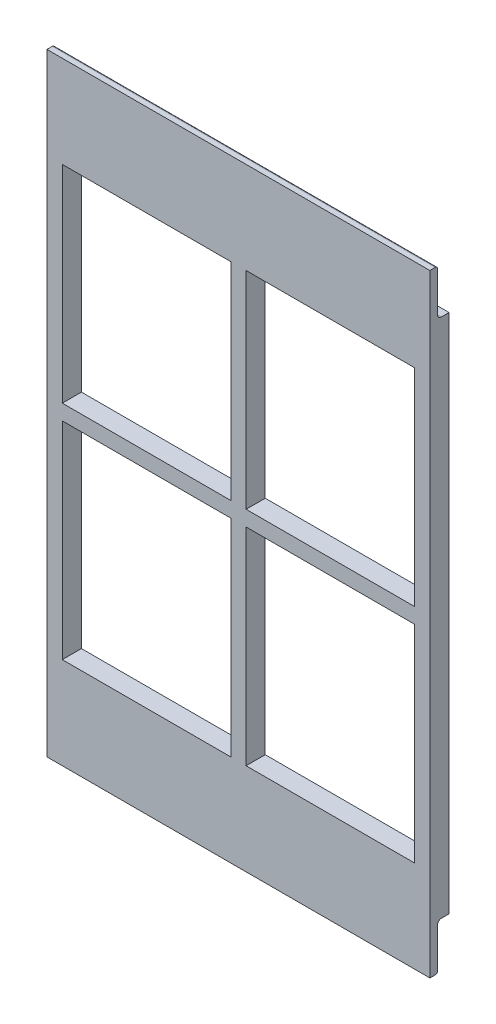
ISO-10303-21;
HEADER;
FILE_DESCRIPTION(('STEP AP214'),'2;1');
FILE_NAME('part.step','',(''),(''),'','','');
FILE_SCHEMA(('AUTOMOTIVE_DESIGN { 1 0 10303 214 1 1 1 1 }'));
ENDSEC;
DATA;
#1=APPLICATION_CONTEXT('core data for automotive mechanical design processes');
#2=APPLICATION_PROTOCOL_DEFINITION('international standard','automotive_design',2000,#1);
#3=PRODUCT_CONTEXT('',#1,'mechanical');
#4=PRODUCT('Part','Part','',(#3));
#5=PRODUCT_RELATED_PRODUCT_CATEGORY('part','',(#4));
#6=PRODUCT_DEFINITION_FORMATION('','',#4);
#7=PRODUCT_DEFINITION_CONTEXT('part definition',#1,'design');
#8=PRODUCT_DEFINITION('design','',#6,#7);
#9=PRODUCT_DEFINITION_SHAPE('','',#8);
#10=(LENGTH_UNIT() NAMED_UNIT(*) SI_UNIT(.MILLI.,.METRE.));
#11=(NAMED_UNIT(*) PLANE_ANGLE_UNIT() SI_UNIT($,.RADIAN.));
#12=(NAMED_UNIT(*) SI_UNIT($,.STERADIAN.) SOLID_ANGLE_UNIT());
#13=UNCERTAINTY_MEASURE_WITH_UNIT(LENGTH_MEASURE(1.E-05),#10,'distance_accuracy_value','');
#14=(GEOMETRIC_REPRESENTATION_CONTEXT(3) GLOBAL_UNCERTAINTY_ASSIGNED_CONTEXT((#13)) GLOBAL_UNIT_ASSIGNED_CONTEXT((#10,
#11,#12)) REPRESENTATION_CONTEXT('',''));
#15=CARTESIAN_POINT('',(0.,0.,0.));
#16=DIRECTION('',(0.,0.,1.));
#17=DIRECTION('',(1.,0.,0.));
#18=AXIS2_PLACEMENT_3D('',#15,#16,#17);
#19=CARTESIAN_POINT('',(-17.9629629629629,-37.8803703703704,2.5));
#20=DIRECTION('',(0.,0.,1.));
#21=DIRECTION('',(1.,0.,0.));
#22=AXIS2_PLACEMENT_3D('',#19,#20,#21);
#23=PLANE('',#22);
#24=DIRECTION('',(0.,-1.,0.));
#25=VECTOR('',#24,1.);
#26=CARTESIAN_POINT('',(8.03703703703706,0.,2.5));
#27=LINE('',#26,#25);
#28=CARTESIAN_POINT('',(8.03703703703705,30.1321166393185,2.5));
#29=VERTEX_POINT('',#28);
#30=CARTESIAN_POINT('',(8.03703703703706,3.12962962962963,2.5));
#31=VERTEX_POINT('',#30);
#32=EDGE_CURVE('E38',#29,#31,#27,.T.);
#33=ORIENTED_EDGE('',*,*,#32,.T.);
#34=DIRECTION('',(1.,0.,0.));
#35=VECTOR('',#34,1.);
#36=CARTESIAN_POINT('',(0.,3.12962962962963,2.5));
#37=LINE('',#36,#35);
#38=CARTESIAN_POINT('',(30.0370370370371,3.12962962962964,2.5));
#39=VERTEX_POINT('',#38);
#40=EDGE_CURVE('E407',#31,#39,#37,.T.);
#41=ORIENTED_EDGE('',*,*,#40,.T.);
#42=DIRECTION('',(0.,1.,0.));
#43=VECTOR('',#42,1.);
#44=CARTESIAN_POINT('',(30.0370370370371,0.,2.5));
#45=LINE('',#44,#43);
#46=CARTESIAN_POINT('',(30.0370370370371,30.1321166393185,2.5));
#47=VERTEX_POINT('',#46);
#48=EDGE_CURVE('E416',#39,#47,#45,.T.);
#49=ORIENTED_EDGE('',*,*,#48,.T.);
#50=DIRECTION('',(1.,0.,0.));
#51=VECTOR('',#50,1.);
#52=CARTESIAN_POINT('',(0.,30.1321166393185,2.5));
#53=LINE('',#52,#51);
#54=EDGE_CURVE('E397',#29,#47,#53,.T.);
#55=ORIENTED_EDGE('',*,*,#54,.F.);
#56=EDGE_LOOP('',(#33,#41,#49,#55));
#57=FACE_BOUND('',#56,.T.);
#58=DIRECTION('',(0.,-1.,0.));
#59=VECTOR('',#58,1.);
#60=CARTESIAN_POINT('',(8.03703703703706,0.,2.5));
#61=LINE('',#60,#59);
#62=CARTESIAN_POINT('',(8.03703703703706,1.12962962962964,2.5));
#63=VERTEX_POINT('',#62);
#64=CARTESIAN_POINT('',(8.03703703703706,-25.8703703703704,2.5));
#65=VERTEX_POINT('',#64);
#66=EDGE_CURVE('E229',#63,#65,#61,.T.);
#67=ORIENTED_EDGE('',*,*,#66,.T.);
#68=DIRECTION('',(1.,0.,0.));
#69=VECTOR('',#68,1.);
#70=CARTESIAN_POINT('',(0.,-25.8703703703704,2.5));
#71=LINE('',#70,#69);
#72=CARTESIAN_POINT('',(30.0370370370371,-25.8703703703704,2.5));
#73=VERTEX_POINT('',#72);
#74=EDGE_CURVE('E394',#65,#73,#71,.T.);
#75=ORIENTED_EDGE('',*,*,#74,.T.);
#76=DIRECTION('',(0.,1.,0.));
#77=VECTOR('',#76,1.);
#78=CARTESIAN_POINT('',(30.0370370370371,0.,2.5));
#79=LINE('',#78,#77);
#80=CARTESIAN_POINT('',(30.0370370370371,1.12962962962964,2.5));
#81=VERTEX_POINT('',#80);
#82=EDGE_CURVE('E404',#73,#81,#79,.T.);
#83=ORIENTED_EDGE('',*,*,#82,.T.);
#84=DIRECTION('',(1.,0.,0.));
#85=VECTOR('',#84,1.);
#86=CARTESIAN_POINT('',(0.,1.12962962962963,2.5));
#87=LINE('',#86,#85);
#88=EDGE_CURVE('E391',#63,#81,#87,.T.);
#89=ORIENTED_EDGE('',*,*,#88,.F.);
#90=EDGE_LOOP('',(#67,#75,#83,#89));
#91=FACE_BOUND('',#90,.T.);
#92=DIRECTION('',(0.,-1.,0.));
#93=VECTOR('',#92,1.);
#94=CARTESIAN_POINT('',(-15.9629629629629,0.,2.5));
#95=LINE('',#94,#93);
#96=CARTESIAN_POINT('',(-15.9629629629629,30.1321166393185,2.5));
#97=VERTEX_POINT('',#96);
#98=CARTESIAN_POINT('',(-15.9629629629629,3.12962962962963,2.5));
#99=VERTEX_POINT('',#98);
#100=EDGE_CURVE('E386',#97,#99,#95,.T.);
#101=ORIENTED_EDGE('',*,*,#100,.T.);
#102=DIRECTION('',(1.,0.,0.));
#103=VECTOR('',#102,1.);
#104=CARTESIAN_POINT('',(0.,3.12962962962963,2.5));
#105=LINE('',#104,#103);
#106=CARTESIAN_POINT('',(6.03703703703705,3.12962962962963,2.5));
#107=VERTEX_POINT('',#106);
#108=EDGE_CURVE('E43',#99,#107,#105,.T.);
#109=ORIENTED_EDGE('',*,*,#108,.T.);
#110=DIRECTION('',(0.,-1.,0.));
#111=VECTOR('',#110,1.);
#112=CARTESIAN_POINT('',(6.03703703703705,0.,2.5));
#113=LINE('',#112,#111);
#114=CARTESIAN_POINT('',(6.03703703703705,30.1321166393185,2.5));
#115=VERTEX_POINT('',#114);
#116=EDGE_CURVE('E395',#115,#107,#113,.T.);
#117=ORIENTED_EDGE('',*,*,#116,.F.);
#118=DIRECTION('',(1.,0.,0.));
#119=VECTOR('',#118,1.);
#120=CARTESIAN_POINT('',(0.,30.1321166393185,2.5));
#121=LINE('',#120,#119);
#122=EDGE_CURVE('E389',#97,#115,#121,.T.);
#123=ORIENTED_EDGE('',*,*,#122,.F.);
#124=EDGE_LOOP('',(#101,#109,#117,#123));
#125=FACE_BOUND('',#124,.T.);
#126=DIRECTION('',(0.,1.,0.));
#127=VECTOR('',#126,1.);
#128=CARTESIAN_POINT('',(-17.9629629629629,0.,2.5));
#129=LINE('',#128,#127);
#130=CARTESIAN_POINT('',(-17.9629629629629,-31.8703703703704,2.5));
#131=VERTEX_POINT('',#130);
#132=CARTESIAN_POINT('',(-17.9629629629629,36.1296296296296,2.5));
#133=VERTEX_POINT('',#132);
#134=EDGE_CURVE('E387',#131,#133,#129,.T.);
#135=ORIENTED_EDGE('',*,*,#134,.T.);
#136=DIRECTION('',(1.,0.,0.));
#137=VECTOR('',#136,1.);
#138=CARTESIAN_POINT('',(-17.9629629629629,36.1296296296296,2.5));
#139=LINE('',#138,#137);
#140=CARTESIAN_POINT('',(32.0370370370371,36.1296296296296,2.5));
#141=VERTEX_POINT('',#140);
#142=EDGE_CURVE('E11',#133,#141,#139,.T.);
#143=ORIENTED_EDGE('',*,*,#142,.T.);
#144=DIRECTION('',(0.,-1.,0.));
#145=VECTOR('',#144,1.);
#146=CARTESIAN_POINT('',(32.0370370370371,0.,2.5));
#147=LINE('',#146,#145);
#148=CARTESIAN_POINT('',(32.0370370370371,-31.8703703703704,2.5));
#149=VERTEX_POINT('',#148);
#150=EDGE_CURVE('E51',#141,#149,#147,.T.);
#151=ORIENTED_EDGE('',*,*,#150,.T.);
#152=DIRECTION('',(1.,0.,0.));
#153=VECTOR('',#152,1.);
#154=CARTESIAN_POINT('',(-17.9629629629629,-31.8703703703704,2.5));
#155=LINE('',#154,#153);
#156=EDGE_CURVE('E383',#131,#149,#155,.T.);
#157=ORIENTED_EDGE('',*,*,#156,.F.);
#158=EDGE_LOOP('',(#135,#143,#151,#157));
#159=FACE_BOUND('',#158,.T.);
#160=DIRECTION('',(0.,-1.,0.));
#161=VECTOR('',#160,1.);
#162=CARTESIAN_POINT('',(-15.9629629629629,0.,2.5));
#163=LINE('',#162,#161);
#164=CARTESIAN_POINT('',(-15.9629629629629,1.12962962962963,2.5));
#165=VERTEX_POINT('',#164);
#166=CARTESIAN_POINT('',(-15.9629629629629,-25.8703703703704,2.5));
#167=VERTEX_POINT('',#166);
#168=EDGE_CURVE('E403',#165,#167,#163,.T.);
#169=ORIENTED_EDGE('',*,*,#168,.T.);
#170=DIRECTION('',(1.,0.,0.));
#171=VECTOR('',#170,1.);
#172=CARTESIAN_POINT('',(0.,-25.8703703703704,2.5));
#173=LINE('',#172,#171);
#174=CARTESIAN_POINT('',(6.03703703703706,-25.8703703703704,2.5));
#175=VERTEX_POINT('',#174);
#176=EDGE_CURVE('E411',#167,#175,#173,.T.);
#177=ORIENTED_EDGE('',*,*,#176,.T.);
#178=DIRECTION('',(0.,-1.,0.));
#179=VECTOR('',#178,1.);
#180=CARTESIAN_POINT('',(6.03703703703705,0.,2.5));
#181=LINE('',#180,#179);
#182=CARTESIAN_POINT('',(6.03703703703705,1.12962962962963,2.5));
#183=VERTEX_POINT('',#182);
#184=EDGE_CURVE('E409',#183,#175,#181,.T.);
#185=ORIENTED_EDGE('',*,*,#184,.F.);
#186=DIRECTION('',(1.,0.,0.));
#187=VECTOR('',#186,1.);
#188=CARTESIAN_POINT('',(0.,1.12962962962963,2.5));
#189=LINE('',#188,#187);
#190=EDGE_CURVE('E418',#165,#183,#189,.T.);
#191=ORIENTED_EDGE('',*,*,#190,.F.);
#192=EDGE_LOOP('',(#169,#177,#185,#191));
#193=FACE_BOUND('',#192,.T.);
#194=ADVANCED_FACE('F35',(#57,#91,#125,#159,#193),#23,.F.);
#195=CARTESIAN_POINT('',(-17.9629629629629,0.,5.));
#196=DIRECTION('',(-1.,0.,0.));
#197=DIRECTION('',(0.,0.,1.));
#198=AXIS2_PLACEMENT_3D('',#195,#196,#197);
#199=PLANE('',#198);
#200=ORIENTED_EDGE('',*,*,#134,.F.);
#201=DIRECTION('',(0.,0.,1.));
#202=VECTOR('',#201,1.);
#203=CARTESIAN_POINT('',(-17.9629629629629,-31.8703703703704,0.));
#204=LINE('',#203,#202);
#205=CARTESIAN_POINT('',(-17.9629629629629,-31.8703703703704,3.5));
#206=VERTEX_POINT('',#205);
#207=EDGE_CURVE('E251',#131,#206,#204,.T.);
#208=ORIENTED_EDGE('',*,*,#207,.T.);
#209=CARTESIAN_POINT('',(-17.9629629629629,-32.3703703703704,3.5));
#210=DIRECTION('',(-1.,0.,0.));
#211=DIRECTION('',(0.,0.,1.));
#212=AXIS2_PLACEMENT_3D('',#209,#210,#211);
#213=CIRCLE('',#212,0.5);
#214=CARTESIAN_POINT('',(-17.9629629629629,-32.3703703703704,4.));
#215=VERTEX_POINT('',#214);
#216=EDGE_CURVE('E364',#206,#215,#213,.F.);
#217=ORIENTED_EDGE('',*,*,#216,.T.);
#218=DIRECTION('',(0.,-1.,0.));
#219=VECTOR('',#218,1.);
#220=CARTESIAN_POINT('',(-17.9629629629629,0.,4.00000000000001));
#221=LINE('',#220,#219);
#222=CARTESIAN_POINT('',(-17.9629629629629,-37.5703703703704,4.));
#223=VERTEX_POINT('',#222);
#224=EDGE_CURVE('E247',#215,#223,#221,.T.);
#225=ORIENTED_EDGE('',*,*,#224,.T.);
#226=CARTESIAN_POINT('',(-17.9629629629629,-37.5703703703704,4.3));
#227=DIRECTION('',(-1.,0.,0.));
#228=DIRECTION('',(0.,0.,1.));
#229=AXIS2_PLACEMENT_3D('',#226,#227,#228);
#230=CIRCLE('',#229,0.3);
#231=CARTESIAN_POINT('',(-17.9629629629629,-37.8703703703704,4.3));
#232=VERTEX_POINT('',#231);
#233=EDGE_CURVE('E370',#223,#232,#230,.T.);
#234=ORIENTED_EDGE('',*,*,#233,.T.);
#235=DIRECTION('',(0.,0.,-1.));
#236=VECTOR('',#235,1.);
#237=CARTESIAN_POINT('',(-17.9629629629629,-37.8703703703704,5.));
#238=LINE('',#237,#236);
#239=CARTESIAN_POINT('',(-17.9629629629629,-37.8703703703704,5.));
#240=VERTEX_POINT('',#239);
#241=EDGE_CURVE('E300',#240,#232,#238,.T.);
#242=ORIENTED_EDGE('',*,*,#241,.F.);
#243=DIRECTION('',(0.,1.,0.));
#244=VECTOR('',#243,1.);
#245=CARTESIAN_POINT('',(-17.9629629629629,0.,5.));
#246=LINE('',#245,#244);
#247=CARTESIAN_POINT('',(-17.9629629629629,42.1296296296296,5.));
#248=VERTEX_POINT('',#247);
#249=EDGE_CURVE('E439',#240,#248,#246,.T.);
#250=ORIENTED_EDGE('',*,*,#249,.T.);
#251=DIRECTION('',(0.,0.,-1.));
#252=VECTOR('',#251,1.);
#253=CARTESIAN_POINT('',(-17.9629629629629,42.1296296296296,5.));
#254=LINE('',#253,#252);
#255=CARTESIAN_POINT('',(-17.9629629629629,42.1296296296296,4.3));
#256=VERTEX_POINT('',#255);
#257=EDGE_CURVE('E310',#248,#256,#254,.T.);
#258=ORIENTED_EDGE('',*,*,#257,.T.);
#259=CARTESIAN_POINT('',(-17.9629629629629,41.8296296296297,4.3));
#260=DIRECTION('',(-1.,0.,0.));
#261=DIRECTION('',(0.,0.,1.));
#262=AXIS2_PLACEMENT_3D('',#259,#260,#261);
#263=CIRCLE('',#262,0.3);
#264=CARTESIAN_POINT('',(-17.9629629629629,41.8296296296297,4.));
#265=VERTEX_POINT('',#264);
#266=EDGE_CURVE('E372',#256,#265,#263,.T.);
#267=ORIENTED_EDGE('',*,*,#266,.T.);
#268=DIRECTION('',(0.,1.,0.));
#269=VECTOR('',#268,1.);
#270=CARTESIAN_POINT('',(-17.9629629629629,0.,4.00000000000001));
#271=LINE('',#270,#269);
#272=CARTESIAN_POINT('',(-17.9629629629629,36.6296296296296,4.));
#273=VERTEX_POINT('',#272);
#274=EDGE_CURVE('E563',#273,#265,#271,.T.);
#275=ORIENTED_EDGE('',*,*,#274,.F.);
#276=CARTESIAN_POINT('',(-17.9629629629629,36.6296296296296,3.5));
#277=DIRECTION('',(-1.,0.,0.));
#278=DIRECTION('',(0.,0.,1.));
#279=AXIS2_PLACEMENT_3D('',#276,#277,#278);
#280=CIRCLE('',#279,0.5);
#281=CARTESIAN_POINT('',(-17.9629629629629,36.1296296296296,3.5));
#282=VERTEX_POINT('',#281);
#283=EDGE_CURVE('E358',#273,#282,#280,.F.);
#284=ORIENTED_EDGE('',*,*,#283,.T.);
#285=DIRECTION('',(0.,0.,1.));
#286=VECTOR('',#285,1.);
#287=CARTESIAN_POINT('',(-17.9629629629629,36.1296296296296,0.));
#288=LINE('',#287,#286);
#289=EDGE_CURVE('E566',#133,#282,#288,.T.);
#290=ORIENTED_EDGE('',*,*,#289,.F.);
#291=EDGE_LOOP('',(#200,#208,#217,#225,#234,#242,#250,#258,#267,#275,#284,#290));
#292=FACE_BOUND('',#291,.T.);
#293=ADVANCED_FACE('F464',(#292),#199,.T.);
#294=CARTESIAN_POINT('',(32.0370370370371,0.,5.));
#295=DIRECTION('',(1.,0.,0.));
#296=DIRECTION('',(0.,1.,0.));
#297=AXIS2_PLACEMENT_3D('',#294,#295,#296);
#298=PLANE('',#297);
#299=ORIENTED_EDGE('',*,*,#150,.F.);
#300=DIRECTION('',(0.,0.,1.));
#301=VECTOR('',#300,1.);
#302=CARTESIAN_POINT('',(32.0370370370371,36.1296296296296,0.));
#303=LINE('',#302,#301);
#304=CARTESIAN_POINT('',(32.0370370370371,36.1296296296296,3.5));
#305=VERTEX_POINT('',#304);
#306=EDGE_CURVE('E567',#141,#305,#303,.T.);
#307=ORIENTED_EDGE('',*,*,#306,.T.);
#308=CARTESIAN_POINT('',(32.0370370370371,36.6296296296296,3.5));
#309=DIRECTION('',(1.,0.,0.));
#310=DIRECTION('',(0.,1.,0.));
#311=AXIS2_PLACEMENT_3D('',#308,#309,#310);
#312=CIRCLE('',#311,0.5);
#313=CARTESIAN_POINT('',(32.0370370370371,36.6296296296296,4.));
#314=VERTEX_POINT('',#313);
#315=EDGE_CURVE('E356',#305,#314,#312,.F.);
#316=ORIENTED_EDGE('',*,*,#315,.T.);
#317=DIRECTION('',(0.,1.,0.));
#318=VECTOR('',#317,1.);
#319=CARTESIAN_POINT('',(32.0370370370371,0.,4.00000000000001));
#320=LINE('',#319,#318);
#321=CARTESIAN_POINT('',(32.0370370370371,41.8296296296297,4.));
#322=VERTEX_POINT('',#321);
#323=EDGE_CURVE('E561',#314,#322,#320,.T.);
#324=ORIENTED_EDGE('',*,*,#323,.T.);
#325=CARTESIAN_POINT('',(32.0370370370371,41.8296296296297,4.3));
#326=DIRECTION('',(1.,0.,0.));
#327=DIRECTION('',(0.,1.,0.));
#328=AXIS2_PLACEMENT_3D('',#325,#326,#327);
#329=CIRCLE('',#328,0.3);
#330=CARTESIAN_POINT('',(32.0370370370371,42.1296296296296,4.3));
#331=VERTEX_POINT('',#330);
#332=EDGE_CURVE('E368',#322,#331,#329,.T.);
#333=ORIENTED_EDGE('',*,*,#332,.T.);
#334=DIRECTION('',(0.,0.,-1.));
#335=VECTOR('',#334,1.);
#336=CARTESIAN_POINT('',(32.0370370370371,42.1296296296296,5.));
#337=LINE('',#336,#335);
#338=CARTESIAN_POINT('',(32.0370370370371,42.1296296296296,5.));
#339=VERTEX_POINT('',#338);
#340=EDGE_CURVE('E313',#339,#331,#337,.T.);
#341=ORIENTED_EDGE('',*,*,#340,.F.);
#342=DIRECTION('',(0.,-1.,0.));
#343=VECTOR('',#342,1.);
#344=CARTESIAN_POINT('',(32.0370370370371,0.,5.));
#345=LINE('',#344,#343);
#346=CARTESIAN_POINT('',(32.0370370370371,-37.8703703703704,5.));
#347=VERTEX_POINT('',#346);
#348=EDGE_CURVE('E283',#339,#347,#345,.T.);
#349=ORIENTED_EDGE('',*,*,#348,.T.);
#350=DIRECTION('',(0.,0.,-1.));
#351=VECTOR('',#350,1.);
#352=CARTESIAN_POINT('',(32.0370370370371,-37.8703703703704,5.));
#353=LINE('',#352,#351);
#354=CARTESIAN_POINT('',(32.0370370370371,-37.8703703703704,4.3));
#355=VERTEX_POINT('',#354);
#356=EDGE_CURVE('E316',#347,#355,#353,.T.);
#357=ORIENTED_EDGE('',*,*,#356,.T.);
#358=CARTESIAN_POINT('',(32.0370370370371,-37.5703703703704,4.3));
#359=DIRECTION('',(1.,0.,0.));
#360=DIRECTION('',(0.,1.,0.));
#361=AXIS2_PLACEMENT_3D('',#358,#359,#360);
#362=CIRCLE('',#361,0.3);
#363=CARTESIAN_POINT('',(32.0370370370371,-37.5703703703704,4.));
#364=VERTEX_POINT('',#363);
#365=EDGE_CURVE('E366',#355,#364,#362,.T.);
#366=ORIENTED_EDGE('',*,*,#365,.T.);
#367=DIRECTION('',(0.,-1.,0.));
#368=VECTOR('',#367,1.);
#369=CARTESIAN_POINT('',(32.0370370370371,0.,4.00000000000001));
#370=LINE('',#369,#368);
#371=CARTESIAN_POINT('',(32.0370370370371,-32.3703703703704,4.));
#372=VERTEX_POINT('',#371);
#373=EDGE_CURVE('E575',#372,#364,#370,.T.);
#374=ORIENTED_EDGE('',*,*,#373,.F.);
#375=CARTESIAN_POINT('',(32.0370370370371,-32.3703703703704,3.5));
#376=DIRECTION('',(1.,0.,0.));
#377=DIRECTION('',(0.,1.,0.));
#378=AXIS2_PLACEMENT_3D('',#375,#376,#377);
#379=CIRCLE('',#378,0.5);
#380=CARTESIAN_POINT('',(32.0370370370371,-31.8703703703704,3.5));
#381=VERTEX_POINT('',#380);
#382=EDGE_CURVE('E361',#372,#381,#379,.F.);
#383=ORIENTED_EDGE('',*,*,#382,.T.);
#384=DIRECTION('',(0.,0.,1.));
#385=VECTOR('',#384,1.);
#386=CARTESIAN_POINT('',(32.0370370370371,-31.8703703703704,0.));
#387=LINE('',#386,#385);
#388=EDGE_CURVE('E573',#149,#381,#387,.T.);
#389=ORIENTED_EDGE('',*,*,#388,.F.);
#390=EDGE_LOOP('',(#299,#307,#316,#324,#333,#341,#349,#357,#366,#374,#383,#389));
#391=FACE_BOUND('',#390,.T.);
#392=ADVANCED_FACE('F564',(#391),#298,.T.);
#393=CARTESIAN_POINT('',(0.,42.1296296296296,5.));
#394=DIRECTION('',(0.,1.,0.));
#395=DIRECTION('',(0.,0.,1.));
#396=AXIS2_PLACEMENT_3D('',#393,#394,#395);
#397=PLANE('',#396);
#398=ORIENTED_EDGE('',*,*,#340,.T.);
#399=DIRECTION('',(1.,0.,0.));
#400=VECTOR('',#399,1.);
#401=CARTESIAN_POINT('',(0.,42.1296296296296,4.3));
#402=LINE('',#401,#400);
#403=EDGE_CURVE('E377',#331,#256,#402,.F.);
#404=ORIENTED_EDGE('',*,*,#403,.T.);
#405=ORIENTED_EDGE('',*,*,#257,.F.);
#406=DIRECTION('',(1.,0.,0.));
#407=VECTOR('',#406,1.);
#408=CARTESIAN_POINT('',(0.,42.1296296296296,5.));
#409=LINE('',#408,#407);
#410=EDGE_CURVE('E275',#248,#339,#409,.T.);
#411=ORIENTED_EDGE('',*,*,#410,.T.);
#412=EDGE_LOOP('',(#398,#404,#405,#411));
#413=FACE_BOUND('',#412,.T.);
#414=ADVANCED_FACE('F503',(#413),#397,.T.);
#415=CARTESIAN_POINT('',(-15.9629629629629,0.,5.));
#416=DIRECTION('',(1.,0.,0.));
#417=DIRECTION('',(0.,1.,0.));
#418=AXIS2_PLACEMENT_3D('',#415,#416,#417);
#419=PLANE('',#418);
#420=ORIENTED_EDGE('',*,*,#100,.F.);
#421=DIRECTION('',(0.,0.,-1.));
#422=VECTOR('',#421,1.);
#423=CARTESIAN_POINT('',(-15.9629629629629,30.1321166393185,5.));
#424=LINE('',#423,#422);
#425=CARTESIAN_POINT('',(-15.9629629629629,30.1321166393185,5.));
#426=VERTEX_POINT('',#425);
#427=EDGE_CURVE('E306',#426,#97,#424,.T.);
#428=ORIENTED_EDGE('',*,*,#427,.F.);
#429=DIRECTION('',(0.,-1.,0.));
#430=VECTOR('',#429,1.);
#431=CARTESIAN_POINT('',(-15.9629629629629,0.,5.));
#432=LINE('',#431,#430);
#433=CARTESIAN_POINT('',(-15.9629629629629,3.12962962962963,5.));
#434=VERTEX_POINT('',#433);
#435=EDGE_CURVE('E266',#426,#434,#432,.T.);
#436=ORIENTED_EDGE('',*,*,#435,.T.);
#437=DIRECTION('',(0.,0.,-1.));
#438=VECTOR('',#437,1.);
#439=CARTESIAN_POINT('',(-15.9629629629629,3.12962962962963,5.));
#440=LINE('',#439,#438);
#441=EDGE_CURVE('E297',#434,#99,#440,.T.);
#442=ORIENTED_EDGE('',*,*,#441,.T.);
#443=EDGE_LOOP('',(#420,#428,#436,#442));
#444=FACE_BOUND('',#443,.T.);
#445=ADVANCED_FACE('F458',(#444),#419,.T.);
#446=CARTESIAN_POINT('',(0.,30.1321166393185,5.));
#447=DIRECTION('',(0.,1.,0.));
#448=DIRECTION('',(-1.,0.,0.));
#449=AXIS2_PLACEMENT_3D('',#446,#447,#448);
#450=PLANE('',#449);
#451=ORIENTED_EDGE('',*,*,#427,.T.);
#452=ORIENTED_EDGE('',*,*,#122,.T.);
#453=DIRECTION('',(0.,0.,-1.));
#454=VECTOR('',#453,1.);
#455=CARTESIAN_POINT('',(6.03703703703705,30.1321166393185,5.));
#456=LINE('',#455,#454);
#457=CARTESIAN_POINT('',(6.03703703703705,30.1321166393185,5.));
#458=VERTEX_POINT('',#457);
#459=EDGE_CURVE('E303',#458,#115,#456,.T.);
#460=ORIENTED_EDGE('',*,*,#459,.F.);
#461=DIRECTION('',(1.,0.,0.));
#462=VECTOR('',#461,1.);
#463=CARTESIAN_POINT('',(0.,30.1321166393185,5.));
#464=LINE('',#463,#462);
#465=EDGE_CURVE('E262',#426,#458,#464,.T.);
#466=ORIENTED_EDGE('',*,*,#465,.F.);
#467=EDGE_LOOP('',(#451,#452,#460,#466));
#468=FACE_BOUND('',#467,.T.);
#469=ADVANCED_FACE('F461',(#468),#450,.F.);
#470=CARTESIAN_POINT('',(6.03703703703705,0.,5.));
#471=DIRECTION('',(1.,0.,0.));
#472=DIRECTION('',(0.,1.,0.));
#473=AXIS2_PLACEMENT_3D('',#470,#471,#472);
#474=PLANE('',#473);
#475=ORIENTED_EDGE('',*,*,#459,.T.);
#476=ORIENTED_EDGE('',*,*,#116,.T.);
#477=DIRECTION('',(0.,0.,-1.));
#478=VECTOR('',#477,1.);
#479=CARTESIAN_POINT('',(6.03703703703705,3.12962962962963,5.));
#480=LINE('',#479,#478);
#481=CARTESIAN_POINT('',(6.03703703703705,3.12962962962963,5.));
#482=VERTEX_POINT('',#481);
#483=EDGE_CURVE('E299',#482,#107,#480,.T.);
#484=ORIENTED_EDGE('',*,*,#483,.F.);
#485=DIRECTION('',(0.,-1.,0.));
#486=VECTOR('',#485,1.);
#487=CARTESIAN_POINT('',(6.03703703703705,0.,5.));
#488=LINE('',#487,#486);
#489=EDGE_CURVE('E281',#458,#482,#488,.T.);
#490=ORIENTED_EDGE('',*,*,#489,.F.);
#491=EDGE_LOOP('',(#475,#476,#484,#490));
#492=FACE_BOUND('',#491,.T.);
#493=ADVANCED_FACE('F453',(#492),#474,.F.);
#494=CARTESIAN_POINT('',(0.,-37.8703703703704,5.));
#495=DIRECTION('',(0.,1.,0.));
#496=DIRECTION('',(0.,0.,1.));
#497=AXIS2_PLACEMENT_3D('',#494,#495,#496);
#498=PLANE('',#497);
#499=ORIENTED_EDGE('',*,*,#241,.T.);
#500=DIRECTION('',(1.,0.,0.));
#501=VECTOR('',#500,1.);
#502=CARTESIAN_POINT('',(0.,-37.8703703703704,4.3));
#503=LINE('',#502,#501);
#504=EDGE_CURVE('E379',#232,#355,#503,.T.);
#505=ORIENTED_EDGE('',*,*,#504,.T.);
#506=ORIENTED_EDGE('',*,*,#356,.F.);
#507=DIRECTION('',(1.,0.,0.));
#508=VECTOR('',#507,1.);
#509=CARTESIAN_POINT('',(0.,-37.8703703703704,5.));
#510=LINE('',#509,#508);
#511=EDGE_CURVE('E289',#240,#347,#510,.T.);
#512=ORIENTED_EDGE('',*,*,#511,.F.);
#513=EDGE_LOOP('',(#499,#505,#506,#512));
#514=FACE_BOUND('',#513,.T.);
#515=ADVANCED_FACE('F492',(#514),#498,.F.);
#516=CARTESIAN_POINT('',(8.03703703703706,0.,5.));
#517=DIRECTION('',(1.,0.,0.));
#518=DIRECTION('',(0.,1.,0.));
#519=AXIS2_PLACEMENT_3D('',#516,#517,#518);
#520=PLANE('',#519);
#521=ORIENTED_EDGE('',*,*,#32,.F.);
#522=DIRECTION('',(0.,0.,-1.));
#523=VECTOR('',#522,1.);
#524=CARTESIAN_POINT('',(8.03703703703705,30.1321166393185,5.));
#525=LINE('',#524,#523);
#526=CARTESIAN_POINT('',(8.03703703703705,30.1321166393185,5.));
#527=VERTEX_POINT('',#526);
#528=EDGE_CURVE('E314',#527,#29,#525,.T.);
#529=ORIENTED_EDGE('',*,*,#528,.F.);
#530=DIRECTION('',(0.,-1.,0.));
#531=VECTOR('',#530,1.);
#532=CARTESIAN_POINT('',(8.03703703703706,0.,5.));
#533=LINE('',#532,#531);
#534=CARTESIAN_POINT('',(8.03703703703706,3.12962962962963,5.));
#535=VERTEX_POINT('',#534);
#536=EDGE_CURVE('E249',#527,#535,#533,.T.);
#537=ORIENTED_EDGE('',*,*,#536,.T.);
#538=DIRECTION('',(0.,0.,-1.));
#539=VECTOR('',#538,1.);
#540=CARTESIAN_POINT('',(8.03703703703706,3.12962962962963,5.));
#541=LINE('',#540,#539);
#542=EDGE_CURVE('E321',#535,#31,#541,.T.);
#543=ORIENTED_EDGE('',*,*,#542,.T.);
#544=EDGE_LOOP('',(#521,#529,#537,#543));
#545=FACE_BOUND('',#544,.T.);
#546=ADVANCED_FACE('F497',(#545),#520,.T.);
#547=ORIENTED_EDGE('',*,*,#528,.T.);
#548=ORIENTED_EDGE('',*,*,#54,.T.);
#549=DIRECTION('',(0.,0.,-1.));
#550=VECTOR('',#549,1.);
#551=CARTESIAN_POINT('',(30.0370370370371,30.1321166393185,5.));
#552=LINE('',#551,#550);
#553=CARTESIAN_POINT('',(30.0370370370371,30.1321166393185,5.));
#554=VERTEX_POINT('',#553);
#555=EDGE_CURVE('E327',#554,#47,#552,.T.);
#556=ORIENTED_EDGE('',*,*,#555,.F.);
#557=EDGE_CURVE('E254',#527,#554,#464,.T.);
#558=ORIENTED_EDGE('',*,*,#557,.F.);
#559=EDGE_LOOP('',(#547,#548,#556,#558));
#560=FACE_BOUND('',#559,.T.);
#561=ADVANCED_FACE('F425',(#560),#450,.F.);
#562=CARTESIAN_POINT('',(30.0370370370371,0.,5.));
#563=DIRECTION('',(-1.,0.,0.));
#564=DIRECTION('',(0.,-1.,0.));
#565=AXIS2_PLACEMENT_3D('',#562,#563,#564);
#566=PLANE('',#565);
#567=ORIENTED_EDGE('',*,*,#48,.F.);
#568=DIRECTION('',(0.,0.,-1.));
#569=VECTOR('',#568,1.);
#570=CARTESIAN_POINT('',(30.0370370370371,3.12962962962964,5.));
#571=LINE('',#570,#569);
#572=CARTESIAN_POINT('',(30.0370370370371,3.12962962962964,5.));
#573=VERTEX_POINT('',#572);
#574=EDGE_CURVE('E323',#573,#39,#571,.T.);
#575=ORIENTED_EDGE('',*,*,#574,.F.);
#576=DIRECTION('',(0.,1.,0.));
#577=VECTOR('',#576,1.);
#578=CARTESIAN_POINT('',(30.0370370370371,0.,5.));
#579=LINE('',#578,#577);
#580=EDGE_CURVE('E260',#573,#554,#579,.T.);
#581=ORIENTED_EDGE('',*,*,#580,.T.);
#582=ORIENTED_EDGE('',*,*,#555,.T.);
#583=EDGE_LOOP('',(#567,#575,#581,#582));
#584=FACE_BOUND('',#583,.T.);
#585=ADVANCED_FACE('F433',(#584),#566,.T.);
#586=CARTESIAN_POINT('',(0.,1.12962962962963,5.));
#587=DIRECTION('',(0.,1.,0.));
#588=DIRECTION('',(-1.,0.,0.));
#589=AXIS2_PLACEMENT_3D('',#586,#587,#588);
#590=PLANE('',#589);
#591=DIRECTION('',(0.,0.,-1.));
#592=VECTOR('',#591,1.);
#593=CARTESIAN_POINT('',(-15.9629629629629,1.12962962962963,5.));
#594=LINE('',#593,#592);
#595=CARTESIAN_POINT('',(-15.9629629629629,1.12962962962963,5.));
#596=VERTEX_POINT('',#595);
#597=EDGE_CURVE('E231',#596,#165,#594,.T.);
#598=ORIENTED_EDGE('',*,*,#597,.T.);
#599=ORIENTED_EDGE('',*,*,#190,.T.);
#600=DIRECTION('',(0.,0.,-1.));
#601=VECTOR('',#600,1.);
#602=CARTESIAN_POINT('',(6.03703703703705,1.12962962962963,5.));
#603=LINE('',#602,#601);
#604=CARTESIAN_POINT('',(6.03703703703705,1.12962962962963,5.));
#605=VERTEX_POINT('',#604);
#606=EDGE_CURVE('E324',#605,#183,#603,.T.);
#607=ORIENTED_EDGE('',*,*,#606,.F.);
#608=DIRECTION('',(1.,0.,0.));
#609=VECTOR('',#608,1.);
#610=CARTESIAN_POINT('',(0.,1.12962962962963,5.));
#611=LINE('',#610,#609);
#612=EDGE_CURVE('E442',#596,#605,#611,.T.);
#613=ORIENTED_EDGE('',*,*,#612,.F.);
#614=EDGE_LOOP('',(#598,#599,#607,#613));
#615=FACE_BOUND('',#614,.T.);
#616=ADVANCED_FACE('F477',(#615),#590,.F.);
#617=ORIENTED_EDGE('',*,*,#606,.T.);
#618=ORIENTED_EDGE('',*,*,#184,.T.);
#619=DIRECTION('',(0.,0.,-1.));
#620=VECTOR('',#619,1.);
#621=CARTESIAN_POINT('',(6.03703703703706,-25.8703703703704,5.));
#622=LINE('',#621,#620);
#623=CARTESIAN_POINT('',(6.03703703703706,-25.8703703703704,5.));
#624=VERTEX_POINT('',#623);
#625=EDGE_CURVE('E336',#624,#175,#622,.T.);
#626=ORIENTED_EDGE('',*,*,#625,.F.);
#627=EDGE_CURVE('E271',#605,#624,#488,.T.);
#628=ORIENTED_EDGE('',*,*,#627,.F.);
#629=EDGE_LOOP('',(#617,#618,#626,#628));
#630=FACE_BOUND('',#629,.T.);
#631=ADVANCED_FACE('F479',(#630),#474,.F.);
#632=CARTESIAN_POINT('',(0.,-25.8703703703704,5.));
#633=DIRECTION('',(0.,1.,0.));
#634=DIRECTION('',(-1.,0.,0.));
#635=AXIS2_PLACEMENT_3D('',#632,#633,#634);
#636=PLANE('',#635);
#637=ORIENTED_EDGE('',*,*,#176,.F.);
#638=DIRECTION('',(0.,0.,-1.));
#639=VECTOR('',#638,1.);
#640=CARTESIAN_POINT('',(-15.9629629629629,-25.8703703703704,5.));
#641=LINE('',#640,#639);
#642=CARTESIAN_POINT('',(-15.9629629629629,-25.8703703703704,5.));
#643=VERTEX_POINT('',#642);
#644=EDGE_CURVE('E334',#643,#167,#641,.T.);
#645=ORIENTED_EDGE('',*,*,#644,.F.);
#646=DIRECTION('',(1.,0.,0.));
#647=VECTOR('',#646,1.);
#648=CARTESIAN_POINT('',(0.,-25.8703703703704,5.));
#649=LINE('',#648,#647);
#650=EDGE_CURVE('E264',#643,#624,#649,.T.);
#651=ORIENTED_EDGE('',*,*,#650,.T.);
#652=ORIENTED_EDGE('',*,*,#625,.T.);
#653=EDGE_LOOP('',(#637,#645,#651,#652));
#654=FACE_BOUND('',#653,.T.);
#655=ADVANCED_FACE('F473',(#654),#636,.T.);
#656=ORIENTED_EDGE('',*,*,#66,.F.);
#657=DIRECTION('',(0.,0.,-1.));
#658=VECTOR('',#657,1.);
#659=CARTESIAN_POINT('',(8.03703703703706,1.12962962962964,5.));
#660=LINE('',#659,#658);
#661=CARTESIAN_POINT('',(8.03703703703706,1.12962962962964,5.));
#662=VERTEX_POINT('',#661);
#663=EDGE_CURVE('E221',#662,#63,#660,.T.);
#664=ORIENTED_EDGE('',*,*,#663,.F.);
#665=CARTESIAN_POINT('',(8.03703703703706,-25.8703703703704,5.));
#666=VERTEX_POINT('',#665);
#667=EDGE_CURVE('E226',#662,#666,#533,.T.);
#668=ORIENTED_EDGE('',*,*,#667,.T.);
#669=DIRECTION('',(0.,0.,-1.));
#670=VECTOR('',#669,1.);
#671=CARTESIAN_POINT('',(8.03703703703706,-25.8703703703704,5.));
#672=LINE('',#671,#670);
#673=EDGE_CURVE('E296',#666,#65,#672,.T.);
#674=ORIENTED_EDGE('',*,*,#673,.T.);
#675=EDGE_LOOP('',(#656,#664,#668,#674));
#676=FACE_BOUND('',#675,.T.);
#677=ADVANCED_FACE('F223',(#676),#520,.T.);
#678=CARTESIAN_POINT('',(0.,1.12962962962963,5.));
#679=DIRECTION('',(0.,1.,0.));
#680=DIRECTION('',(-1.,0.,0.));
#681=AXIS2_PLACEMENT_3D('',#678,#679,#680);
#682=PLANE('',#681);
#683=ORIENTED_EDGE('',*,*,#663,.T.);
#684=ORIENTED_EDGE('',*,*,#88,.T.);
#685=DIRECTION('',(0.,0.,-1.));
#686=VECTOR('',#685,1.);
#687=CARTESIAN_POINT('',(30.0370370370371,1.12962962962964,5.));
#688=LINE('',#687,#686);
#689=CARTESIAN_POINT('',(30.0370370370371,1.12962962962964,5.));
#690=VERTEX_POINT('',#689);
#691=EDGE_CURVE('E232',#690,#81,#688,.T.);
#692=ORIENTED_EDGE('',*,*,#691,.F.);
#693=DIRECTION('',(1.,0.,0.));
#694=VECTOR('',#693,1.);
#695=CARTESIAN_POINT('',(0.,1.12962962962963,5.));
#696=LINE('',#695,#694);
#697=EDGE_CURVE('E235',#662,#690,#696,.T.);
#698=ORIENTED_EDGE('',*,*,#697,.F.);
#699=EDGE_LOOP('',(#683,#684,#692,#698));
#700=FACE_BOUND('',#699,.T.);
#701=ADVANCED_FACE('F236',(#700),#682,.F.);
#702=ORIENTED_EDGE('',*,*,#82,.F.);
#703=DIRECTION('',(0.,0.,-1.));
#704=VECTOR('',#703,1.);
#705=CARTESIAN_POINT('',(30.0370370370371,-25.8703703703704,5.));
#706=LINE('',#705,#704);
#707=CARTESIAN_POINT('',(30.0370370370371,-25.8703703703704,5.));
#708=VERTEX_POINT('',#707);
#709=EDGE_CURVE('E342',#708,#73,#706,.T.);
#710=ORIENTED_EDGE('',*,*,#709,.F.);
#711=EDGE_CURVE('E241',#708,#690,#579,.T.);
#712=ORIENTED_EDGE('',*,*,#711,.T.);
#713=ORIENTED_EDGE('',*,*,#691,.T.);
#714=EDGE_LOOP('',(#702,#710,#712,#713));
#715=FACE_BOUND('',#714,.T.);
#716=ADVANCED_FACE('F511',(#715),#566,.T.);
#717=CARTESIAN_POINT('',(0.,3.12962962962963,5.));
#718=DIRECTION('',(0.,1.,0.));
#719=DIRECTION('',(-1.,0.,0.));
#720=AXIS2_PLACEMENT_3D('',#717,#718,#719);
#721=PLANE('',#720);
#722=ORIENTED_EDGE('',*,*,#40,.F.);
#723=ORIENTED_EDGE('',*,*,#542,.F.);
#724=DIRECTION('',(1.,0.,0.));
#725=VECTOR('',#724,1.);
#726=CARTESIAN_POINT('',(0.,3.12962962962963,5.));
#727=LINE('',#726,#725);
#728=EDGE_CURVE('E437',#535,#573,#727,.T.);
#729=ORIENTED_EDGE('',*,*,#728,.T.);
#730=ORIENTED_EDGE('',*,*,#574,.T.);
#731=EDGE_LOOP('',(#722,#723,#729,#730));
#732=FACE_BOUND('',#731,.T.);
#733=ADVANCED_FACE('F523',(#732),#721,.T.);
#734=ORIENTED_EDGE('',*,*,#168,.F.);
#735=ORIENTED_EDGE('',*,*,#597,.F.);
#736=EDGE_CURVE('E255',#596,#643,#432,.T.);
#737=ORIENTED_EDGE('',*,*,#736,.T.);
#738=ORIENTED_EDGE('',*,*,#644,.T.);
#739=EDGE_LOOP('',(#734,#735,#737,#738));
#740=FACE_BOUND('',#739,.T.);
#741=ADVANCED_FACE('F471',(#740),#419,.T.);
#742=ORIENTED_EDGE('',*,*,#74,.F.);
#743=ORIENTED_EDGE('',*,*,#673,.F.);
#744=EDGE_CURVE('E246',#666,#708,#649,.T.);
#745=ORIENTED_EDGE('',*,*,#744,.T.);
#746=ORIENTED_EDGE('',*,*,#709,.T.);
#747=EDGE_LOOP('',(#742,#743,#745,#746));
#748=FACE_BOUND('',#747,.T.);
#749=ADVANCED_FACE('F487',(#748),#636,.T.);
#750=CARTESIAN_POINT('',(0.,3.12962962962963,5.));
#751=DIRECTION('',(0.,1.,0.));
#752=DIRECTION('',(-1.,0.,0.));
#753=AXIS2_PLACEMENT_3D('',#750,#751,#752);
#754=PLANE('',#753);
#755=ORIENTED_EDGE('',*,*,#108,.F.);
#756=ORIENTED_EDGE('',*,*,#441,.F.);
#757=DIRECTION('',(1.,0.,0.));
#758=VECTOR('',#757,1.);
#759=CARTESIAN_POINT('',(0.,3.12962962962963,5.));
#760=LINE('',#759,#758);
#761=EDGE_CURVE('E293',#434,#482,#760,.T.);
#762=ORIENTED_EDGE('',*,*,#761,.T.);
#763=ORIENTED_EDGE('',*,*,#483,.T.);
#764=EDGE_LOOP('',(#755,#756,#762,#763));
#765=FACE_BOUND('',#764,.T.);
#766=ADVANCED_FACE('F456',(#765),#754,.T.);
#767=CARTESIAN_POINT('',(0.,0.,5.));
#768=DIRECTION('',(0.,0.,1.));
#769=DIRECTION('',(1.,0.,0.));
#770=AXIS2_PLACEMENT_3D('',#767,#768,#769);
#771=PLANE('',#770);
#772=ORIENTED_EDGE('',*,*,#667,.F.);
#773=ORIENTED_EDGE('',*,*,#697,.T.);
#774=ORIENTED_EDGE('',*,*,#711,.F.);
#775=ORIENTED_EDGE('',*,*,#744,.F.);
#776=EDGE_LOOP('',(#772,#773,#774,#775));
#777=FACE_BOUND('',#776,.T.);
#778=ORIENTED_EDGE('',*,*,#612,.T.);
#779=ORIENTED_EDGE('',*,*,#627,.T.);
#780=ORIENTED_EDGE('',*,*,#650,.F.);
#781=ORIENTED_EDGE('',*,*,#736,.F.);
#782=EDGE_LOOP('',(#778,#779,#780,#781));
#783=FACE_BOUND('',#782,.T.);
#784=ORIENTED_EDGE('',*,*,#536,.F.);
#785=ORIENTED_EDGE('',*,*,#557,.T.);
#786=ORIENTED_EDGE('',*,*,#580,.F.);
#787=ORIENTED_EDGE('',*,*,#728,.F.);
#788=EDGE_LOOP('',(#784,#785,#786,#787));
#789=FACE_BOUND('',#788,.T.);
#790=ORIENTED_EDGE('',*,*,#249,.F.);
#791=ORIENTED_EDGE('',*,*,#511,.T.);
#792=ORIENTED_EDGE('',*,*,#348,.F.);
#793=ORIENTED_EDGE('',*,*,#410,.F.);
#794=EDGE_LOOP('',(#790,#791,#792,#793));
#795=FACE_BOUND('',#794,.T.);
#796=ORIENTED_EDGE('',*,*,#435,.F.);
#797=ORIENTED_EDGE('',*,*,#465,.T.);
#798=ORIENTED_EDGE('',*,*,#489,.T.);
#799=ORIENTED_EDGE('',*,*,#761,.F.);
#800=EDGE_LOOP('',(#796,#797,#798,#799));
#801=FACE_BOUND('',#800,.T.);
#802=ADVANCED_FACE('F243',(#777,#783,#789,#795,#801),#771,.T.);
#803=CARTESIAN_POINT('',(-17.9629629629629,-31.8703703703704,0.));
#804=DIRECTION('',(0.,1.,0.));
#805=DIRECTION('',(0.,0.,1.));
#806=AXIS2_PLACEMENT_3D('',#803,#804,#805);
#807=PLANE('',#806);
#808=ORIENTED_EDGE('',*,*,#207,.F.);
#809=ORIENTED_EDGE('',*,*,#156,.T.);
#810=ORIENTED_EDGE('',*,*,#388,.T.);
#811=DIRECTION('',(1.,0.,0.));
#812=VECTOR('',#811,1.);
#813=CARTESIAN_POINT('',(-17.9629629629629,-31.8703703703704,3.5));
#814=LINE('',#813,#812);
#815=EDGE_CURVE('E350',#381,#206,#814,.F.);
#816=ORIENTED_EDGE('',*,*,#815,.T.);
#817=EDGE_LOOP('',(#808,#809,#810,#816));
#818=FACE_BOUND('',#817,.T.);
#819=ADVANCED_FACE('F582',(#818),#807,.F.);
#820=CARTESIAN_POINT('',(-17.9629629629629,0.,4.00000000000001));
#821=DIRECTION('',(0.,0.,1.));
#822=DIRECTION('',(0.,-1.,0.));
#823=AXIS2_PLACEMENT_3D('',#820,#821,#822);
#824=PLANE('',#823);
#825=ORIENTED_EDGE('',*,*,#373,.T.);
#826=DIRECTION('',(1.,0.,0.));
#827=VECTOR('',#826,1.);
#828=CARTESIAN_POINT('',(-17.9629629629629,-37.5703703703704,4.));
#829=LINE('',#828,#827);
#830=EDGE_CURVE('E382',#364,#223,#829,.F.);
#831=ORIENTED_EDGE('',*,*,#830,.T.);
#832=ORIENTED_EDGE('',*,*,#224,.F.);
#833=DIRECTION('',(1.,0.,0.));
#834=VECTOR('',#833,1.);
#835=CARTESIAN_POINT('',(32.0370370370371,-32.3703703703704,4.));
#836=LINE('',#835,#834);
#837=EDGE_CURVE('E353',#215,#372,#836,.T.);
#838=ORIENTED_EDGE('',*,*,#837,.T.);
#839=EDGE_LOOP('',(#825,#831,#832,#838));
#840=FACE_BOUND('',#839,.T.);
#841=ADVANCED_FACE('F586',(#840),#824,.F.);
#842=CARTESIAN_POINT('',(-17.9629629629629,36.1296296296296,0.));
#843=DIRECTION('',(0.,1.,0.));
#844=DIRECTION('',(0.,0.,1.));
#845=AXIS2_PLACEMENT_3D('',#842,#843,#844);
#846=PLANE('',#845);
#847=ORIENTED_EDGE('',*,*,#142,.F.);
#848=ORIENTED_EDGE('',*,*,#289,.T.);
#849=DIRECTION('',(1.,0.,0.));
#850=VECTOR('',#849,1.);
#851=CARTESIAN_POINT('',(32.0370370370371,36.1296296296296,3.5));
#852=LINE('',#851,#850);
#853=EDGE_CURVE('E309',#282,#305,#852,.T.);
#854=ORIENTED_EDGE('',*,*,#853,.T.);
#855=ORIENTED_EDGE('',*,*,#306,.F.);
#856=EDGE_LOOP('',(#847,#848,#854,#855));
#857=FACE_BOUND('',#856,.T.);
#858=ADVANCED_FACE('F611',(#857),#846,.T.);
#859=CARTESIAN_POINT('',(-17.9629629629629,0.,4.00000000000001));
#860=DIRECTION('',(0.,0.,-1.));
#861=DIRECTION('',(0.,1.,0.));
#862=AXIS2_PLACEMENT_3D('',#859,#860,#861);
#863=PLANE('',#862);
#864=ORIENTED_EDGE('',*,*,#274,.T.);
#865=DIRECTION('',(1.,0.,0.));
#866=VECTOR('',#865,1.);
#867=CARTESIAN_POINT('',(-17.9629629629629,41.8296296296297,4.));
#868=LINE('',#867,#866);
#869=EDGE_CURVE('E374',#265,#322,#868,.T.);
#870=ORIENTED_EDGE('',*,*,#869,.T.);
#871=ORIENTED_EDGE('',*,*,#323,.F.);
#872=DIRECTION('',(1.,0.,0.));
#873=VECTOR('',#872,1.);
#874=CARTESIAN_POINT('',(-17.9629629629629,36.6296296296296,4.));
#875=LINE('',#874,#873);
#876=EDGE_CURVE('E348',#314,#273,#875,.F.);
#877=ORIENTED_EDGE('',*,*,#876,.T.);
#878=EDGE_LOOP('',(#864,#870,#871,#877));
#879=FACE_BOUND('',#878,.T.);
#880=ADVANCED_FACE('F529',(#879),#863,.T.);
#881=CARTESIAN_POINT('',(-17.9629629629629,36.6296296296296,3.5));
#882=DIRECTION('',(-1.,0.,0.));
#883=DIRECTION('',(0.,0.,1.));
#884=AXIS2_PLACEMENT_3D('',#881,#882,#883);
#885=CYLINDRICAL_SURFACE('',#884,0.5);
#886=ORIENTED_EDGE('',*,*,#283,.F.);
#887=ORIENTED_EDGE('',*,*,#876,.F.);
#888=ORIENTED_EDGE('',*,*,#315,.F.);
#889=ORIENTED_EDGE('',*,*,#853,.F.);
#890=EDGE_LOOP('',(#886,#887,#888,#889));
#891=FACE_BOUND('',#890,.T.);
#892=ADVANCED_FACE('F525',(#891),#885,.F.);
#893=CARTESIAN_POINT('',(-17.9629629629629,-32.3703703703704,3.5));
#894=DIRECTION('',(-1.,0.,0.));
#895=DIRECTION('',(0.,0.,1.));
#896=AXIS2_PLACEMENT_3D('',#893,#894,#895);
#897=CYLINDRICAL_SURFACE('',#896,0.5);
#898=ORIENTED_EDGE('',*,*,#216,.F.);
#899=ORIENTED_EDGE('',*,*,#815,.F.);
#900=ORIENTED_EDGE('',*,*,#382,.F.);
#901=ORIENTED_EDGE('',*,*,#837,.F.);
#902=EDGE_LOOP('',(#898,#899,#900,#901));
#903=FACE_BOUND('',#902,.T.);
#904=ADVANCED_FACE('F528',(#903),#897,.F.);
#905=CARTESIAN_POINT('',(-17.9629629629629,41.8296296296297,4.3));
#906=DIRECTION('',(1.,0.,0.));
#907=DIRECTION('',(0.,0.,-1.));
#908=AXIS2_PLACEMENT_3D('',#905,#906,#907);
#909=CYLINDRICAL_SURFACE('',#908,0.3);
#910=ORIENTED_EDGE('',*,*,#266,.F.);
#911=ORIENTED_EDGE('',*,*,#403,.F.);
#912=ORIENTED_EDGE('',*,*,#332,.F.);
#913=ORIENTED_EDGE('',*,*,#869,.F.);
#914=EDGE_LOOP('',(#910,#911,#912,#913));
#915=FACE_BOUND('',#914,.T.);
#916=ADVANCED_FACE('F533',(#915),#909,.T.);
#917=CARTESIAN_POINT('',(0.,-37.5703703703704,4.3));
#918=DIRECTION('',(1.,0.,0.));
#919=DIRECTION('',(0.,0.,-1.));
#920=AXIS2_PLACEMENT_3D('',#917,#918,#919);
#921=CYLINDRICAL_SURFACE('',#920,0.3);
#922=ORIENTED_EDGE('',*,*,#233,.F.);
#923=ORIENTED_EDGE('',*,*,#830,.F.);
#924=ORIENTED_EDGE('',*,*,#365,.F.);
#925=ORIENTED_EDGE('',*,*,#504,.F.);
#926=EDGE_LOOP('',(#922,#923,#924,#925));
#927=FACE_BOUND('',#926,.T.);
#928=ADVANCED_FACE('F465',(#927),#921,.T.);
#929=CLOSED_SHELL('',(#194,#293,#392,#414,#445,#469,#493,#515,#546,#561,#585,#616,#631,#655,
#677,#701,#716,#733,#741,#749,#766,#802,#819,#841,#858,#880,#892,#904,#916,#928));
#930=MANIFOLD_SOLID_BREP('B2',#929);
#931=ADVANCED_BREP_SHAPE_REPRESENTATION('',(#18,#930),#14);
#932=SHAPE_DEFINITION_REPRESENTATION(#9,#931);
ENDSEC;
END-ISO-10303-21;
